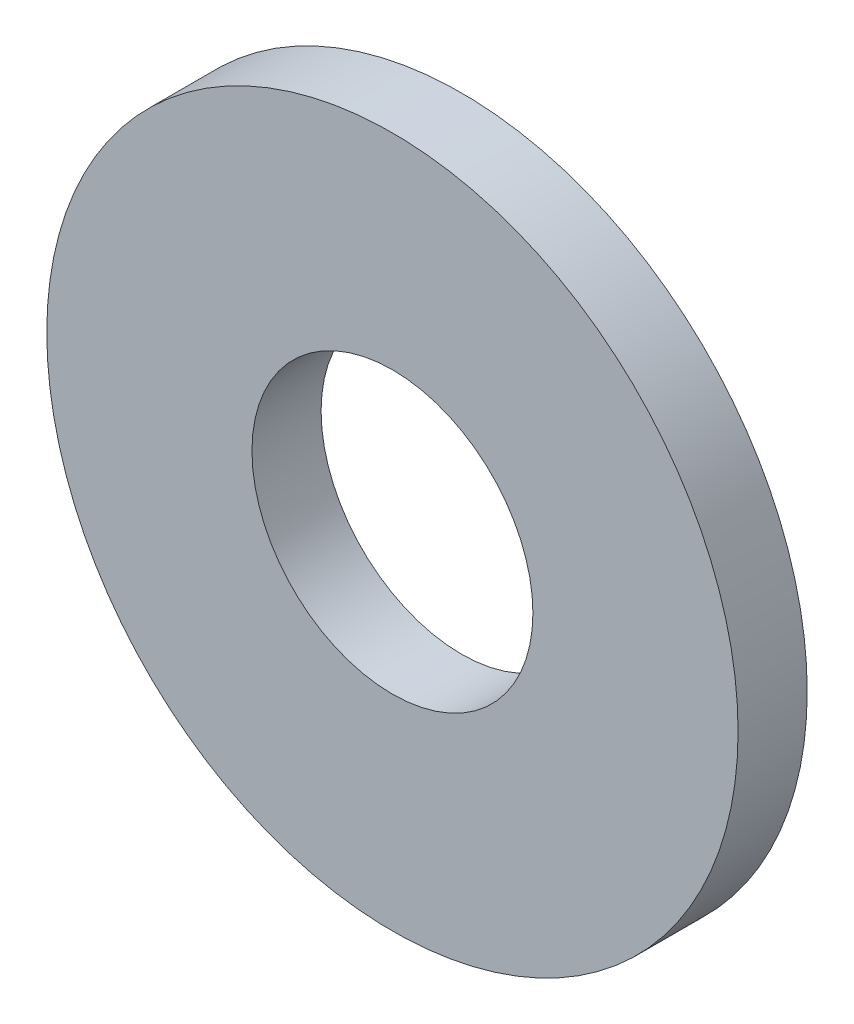
ISO-10303-21;
HEADER;
FILE_DESCRIPTION(('STEP AP214'),'2;1');
FILE_NAME('part.step','',(''),(''),'','','');
FILE_SCHEMA(('AUTOMOTIVE_DESIGN { 1 0 10303 214 1 1 1 1 }'));
ENDSEC;
DATA;
#1=APPLICATION_CONTEXT('core data for automotive mechanical design processes');
#2=APPLICATION_PROTOCOL_DEFINITION('international standard','automotive_design',2000,#1);
#3=PRODUCT_CONTEXT('',#1,'mechanical');
#4=PRODUCT('Part','Part','',(#3));
#5=PRODUCT_RELATED_PRODUCT_CATEGORY('part','',(#4));
#6=PRODUCT_DEFINITION_FORMATION('','',#4);
#7=PRODUCT_DEFINITION_CONTEXT('part definition',#1,'design');
#8=PRODUCT_DEFINITION('design','',#6,#7);
#9=PRODUCT_DEFINITION_SHAPE('','',#8);
#10=(LENGTH_UNIT() NAMED_UNIT(*) SI_UNIT(.MILLI.,.METRE.));
#11=(NAMED_UNIT(*) PLANE_ANGLE_UNIT() SI_UNIT($,.RADIAN.));
#12=(NAMED_UNIT(*) SI_UNIT($,.STERADIAN.) SOLID_ANGLE_UNIT());
#13=UNCERTAINTY_MEASURE_WITH_UNIT(LENGTH_MEASURE(1.E-05),#10,'distance_accuracy_value','');
#14=(GEOMETRIC_REPRESENTATION_CONTEXT(3) GLOBAL_UNCERTAINTY_ASSIGNED_CONTEXT((#13)) GLOBAL_UNIT_ASSIGNED_CONTEXT((#10,
#11,#12)) REPRESENTATION_CONTEXT('',''));
#15=CARTESIAN_POINT('',(0.,0.,0.));
#16=DIRECTION('',(0.,0.,1.));
#17=DIRECTION('',(1.,0.,0.));
#18=AXIS2_PLACEMENT_3D('',#15,#16,#17);
#19=CARTESIAN_POINT('',(0.,0.,0.79375));
#20=DIRECTION('',(0.,0.,1.));
#21=DIRECTION('',(1.,0.,0.));
#22=AXIS2_PLACEMENT_3D('',#19,#20,#21);
#23=PLANE('',#22);
#24=CARTESIAN_POINT('',(0.,0.,0.79375));
#25=DIRECTION('',(0.,0.,1.));
#26=DIRECTION('',(1.,0.,0.));
#27=AXIS2_PLACEMENT_3D('',#24,#25,#26);
#28=CIRCLE('',#27,7.9375);
#29=CARTESIAN_POINT('',(7.9375,0.,0.79375));
#30=VERTEX_POINT('',#29);
#31=EDGE_CURVE('E10',#30,#30,#28,.T.);
#32=ORIENTED_EDGE('',*,*,#31,.T.);
#33=EDGE_LOOP('',(#32));
#34=FACE_BOUND('',#33,.T.);
#35=CARTESIAN_POINT('',(0.,0.,0.79375));
#36=DIRECTION('',(0.,0.,1.));
#37=DIRECTION('',(1.,0.,0.));
#38=AXIS2_PLACEMENT_3D('',#35,#36,#37);
#39=CIRCLE('',#38,3.2258);
#40=CARTESIAN_POINT('',(3.2258,0.,0.79375));
#41=VERTEX_POINT('',#40);
#42=EDGE_CURVE('E44',#41,#41,#39,.T.);
#43=ORIENTED_EDGE('',*,*,#42,.F.);
#44=EDGE_LOOP('',(#43));
#45=FACE_BOUND('',#44,.T.);
#46=ADVANCED_FACE('F33',(#34,#45),#23,.T.);
#47=CARTESIAN_POINT('',(0.,0.,-0.79375));
#48=DIRECTION('',(0.,0.,1.));
#49=DIRECTION('',(1.,0.,0.));
#50=AXIS2_PLACEMENT_3D('',#47,#48,#49);
#51=PLANE('',#50);
#52=CARTESIAN_POINT('',(0.,0.,-0.79375));
#53=DIRECTION('',(0.,0.,1.));
#54=DIRECTION('',(1.,0.,0.));
#55=AXIS2_PLACEMENT_3D('',#52,#53,#54);
#56=CIRCLE('',#55,7.9375);
#57=CARTESIAN_POINT('',(7.9375,0.,-0.79375));
#58=VERTEX_POINT('',#57);
#59=EDGE_CURVE('E37',#58,#58,#56,.T.);
#60=ORIENTED_EDGE('',*,*,#59,.F.);
#61=EDGE_LOOP('',(#60));
#62=FACE_BOUND('',#61,.T.);
#63=CARTESIAN_POINT('',(0.,0.,-0.79375));
#64=DIRECTION('',(0.,0.,1.));
#65=DIRECTION('',(1.,0.,0.));
#66=AXIS2_PLACEMENT_3D('',#63,#64,#65);
#67=CIRCLE('',#66,3.2258);
#68=CARTESIAN_POINT('',(3.2258,0.,-0.79375));
#69=VERTEX_POINT('',#68);
#70=EDGE_CURVE('E46',#69,#69,#67,.T.);
#71=ORIENTED_EDGE('',*,*,#70,.T.);
#72=EDGE_LOOP('',(#71));
#73=FACE_BOUND('',#72,.T.);
#74=ADVANCED_FACE('F56',(#62,#73),#51,.F.);
#75=CARTESIAN_POINT('',(0.,0.,0.79375));
#76=DIRECTION('',(0.,0.,-1.));
#77=DIRECTION('',(-1.,0.,0.));
#78=AXIS2_PLACEMENT_3D('',#75,#76,#77);
#79=CYLINDRICAL_SURFACE('',#78,7.9375);
#80=ORIENTED_EDGE('',*,*,#31,.F.);
#81=EDGE_LOOP('',(#80));
#82=FACE_BOUND('',#81,.T.);
#83=ORIENTED_EDGE('',*,*,#59,.T.);
#84=EDGE_LOOP('',(#83));
#85=FACE_BOUND('',#84,.T.);
#86=ADVANCED_FACE('F35',(#82,#85),#79,.T.);
#87=CARTESIAN_POINT('',(0.,0.,0.79375));
#88=DIRECTION('',(0.,0.,-1.));
#89=DIRECTION('',(-1.,0.,0.));
#90=AXIS2_PLACEMENT_3D('',#87,#88,#89);
#91=CYLINDRICAL_SURFACE('',#90,3.2258);
#92=ORIENTED_EDGE('',*,*,#42,.T.);
#93=EDGE_LOOP('',(#92));
#94=FACE_BOUND('',#93,.T.);
#95=ORIENTED_EDGE('',*,*,#70,.F.);
#96=EDGE_LOOP('',(#95));
#97=FACE_BOUND('',#96,.T.);
#98=ADVANCED_FACE('F52',(#94,#97),#91,.F.);
#99=CLOSED_SHELL('',(#46,#74,#86,#98));
#100=MANIFOLD_SOLID_BREP('B2',#99);
#101=ADVANCED_BREP_SHAPE_REPRESENTATION('',(#18,#100),#14);
#102=SHAPE_DEFINITION_REPRESENTATION(#9,#101);
ENDSEC;
END-ISO-10303-21;
